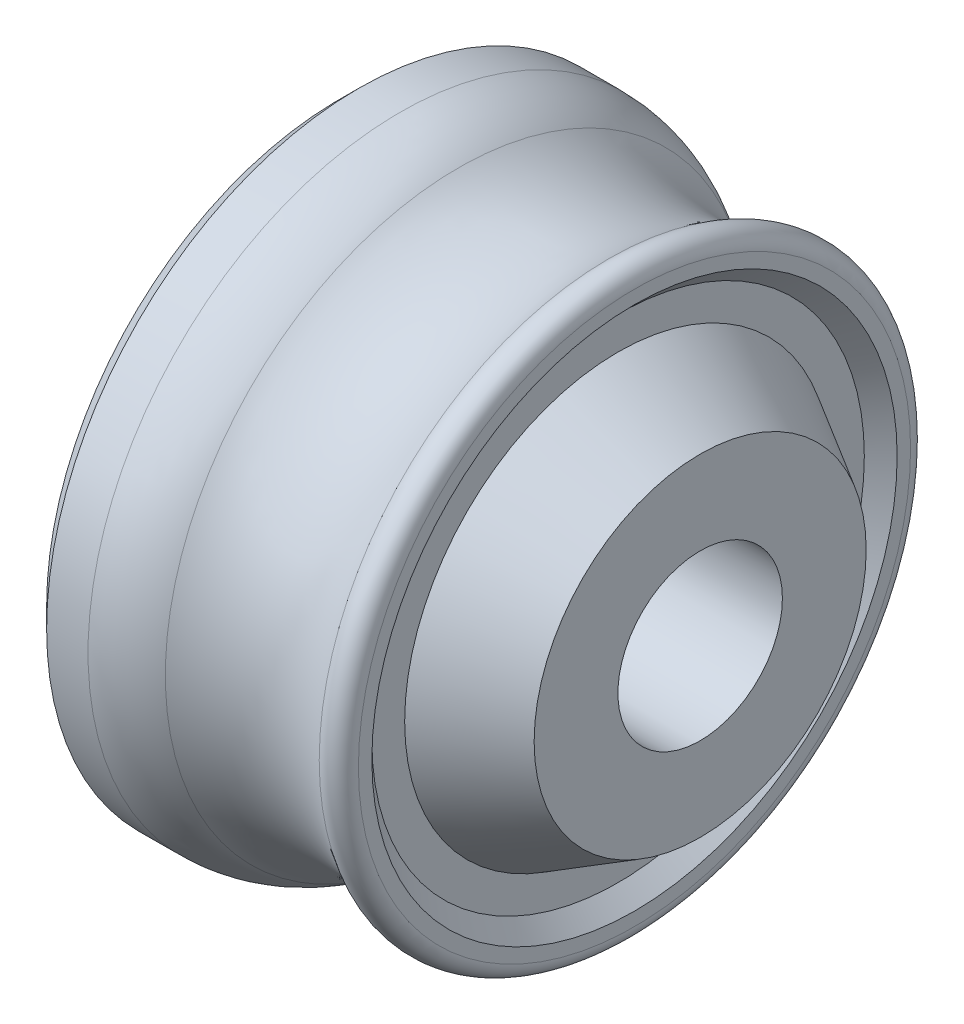
ISO-10303-21;
HEADER;
FILE_DESCRIPTION(('STEP AP214'),'2;1');
FILE_NAME('part.step','',(''),(''),'','','');
FILE_SCHEMA(('AUTOMOTIVE_DESIGN { 1 0 10303 214 1 1 1 1 }'));
ENDSEC;
DATA;
#1=APPLICATION_CONTEXT('core data for automotive mechanical design processes');
#2=APPLICATION_PROTOCOL_DEFINITION('international standard','automotive_design',2000,#1);
#3=PRODUCT_CONTEXT('',#1,'mechanical');
#4=PRODUCT('Part','Part','',(#3));
#5=PRODUCT_RELATED_PRODUCT_CATEGORY('part','',(#4));
#6=PRODUCT_DEFINITION_FORMATION('','',#4);
#7=PRODUCT_DEFINITION_CONTEXT('part definition',#1,'design');
#8=PRODUCT_DEFINITION('design','',#6,#7);
#9=PRODUCT_DEFINITION_SHAPE('','',#8);
#10=(LENGTH_UNIT() NAMED_UNIT(*) SI_UNIT(.MILLI.,.METRE.));
#11=(NAMED_UNIT(*) PLANE_ANGLE_UNIT() SI_UNIT($,.RADIAN.));
#12=(NAMED_UNIT(*) SI_UNIT($,.STERADIAN.) SOLID_ANGLE_UNIT());
#13=UNCERTAINTY_MEASURE_WITH_UNIT(LENGTH_MEASURE(1.E-05),#10,'distance_accuracy_value','');
#14=(GEOMETRIC_REPRESENTATION_CONTEXT(3) GLOBAL_UNCERTAINTY_ASSIGNED_CONTEXT((#13)) GLOBAL_UNIT_ASSIGNED_CONTEXT((#10,
#11,#12)) REPRESENTATION_CONTEXT('',''));
#15=CARTESIAN_POINT('',(0.,0.,0.));
#16=DIRECTION('',(0.,0.,1.));
#17=DIRECTION('',(1.,0.,0.));
#18=AXIS2_PLACEMENT_3D('',#15,#16,#17);
#19=CARTESIAN_POINT('',(0.,0.,0.));
#20=DIRECTION('',(1.,0.,0.));
#21=DIRECTION('',(0.,0.,-1.));
#22=AXIS2_PLACEMENT_3D('',#19,#20,#21);
#23=TOROIDAL_SURFACE('',#22,12.1507513110646,4.);
#24=CARTESIAN_POINT('',(-2.3647404575098,0.,0.));
#25=DIRECTION('',(1.,0.,0.));
#26=DIRECTION('',(0.,0.,-1.));
#27=AXIS2_PLACEMENT_3D('',#24,#25,#26);
#28=CIRCLE('',#27,8.92460770474197);
#29=CARTESIAN_POINT('',(-2.3647404575098,0.,-8.92460770474197));
#30=VERTEX_POINT('',#29);
#31=EDGE_CURVE('E64',#30,#30,#28,.T.);
#32=ORIENTED_EDGE('',*,*,#31,.T.);
#33=EDGE_LOOP('',(#32));
#34=FACE_BOUND('',#33,.T.);
#35=CARTESIAN_POINT('',(2.22222222222222,0.,0.));
#36=DIRECTION('',(-1.,0.,0.));
#37=DIRECTION('',(0.,0.,1.));
#38=AXIS2_PLACEMENT_3D('',#35,#36,#37);
#39=CIRCLE('',#38,8.8248336339322);
#40=CARTESIAN_POINT('',(2.22222222222222,0.,8.8248336339322));
#41=VERTEX_POINT('',#40);
#42=EDGE_CURVE('E72',#41,#41,#39,.T.);
#43=ORIENTED_EDGE('',*,*,#42,.T.);
#44=EDGE_LOOP('',(#43));
#45=FACE_BOUND('',#44,.T.);
#46=ADVANCED_FACE('F39',(#34,#45),#23,.F.);
#47=CARTESIAN_POINT('',(0.,0.,0.));
#48=DIRECTION('',(1.,0.,0.));
#49=DIRECTION('',(0.,0.,-1.));
#50=AXIS2_PLACEMENT_3D('',#47,#48,#49);
#51=CYLINDRICAL_SURFACE('',#50,2.505);
#52=CARTESIAN_POINT('',(-5.4,0.,0.));
#53=DIRECTION('',(-1.,0.,0.));
#54=DIRECTION('',(0.,0.,1.));
#55=AXIS2_PLACEMENT_3D('',#52,#53,#54);
#56=CIRCLE('',#55,2.505);
#57=CARTESIAN_POINT('',(-5.4,0.,2.505));
#58=VERTEX_POINT('',#57);
#59=EDGE_CURVE('E58',#58,#58,#56,.T.);
#60=ORIENTED_EDGE('',*,*,#59,.T.);
#61=EDGE_LOOP('',(#60));
#62=FACE_BOUND('',#61,.T.);
#63=CARTESIAN_POINT('',(5.,0.,0.));
#64=DIRECTION('',(1.,0.,0.));
#65=DIRECTION('',(0.,0.,-1.));
#66=AXIS2_PLACEMENT_3D('',#63,#64,#65);
#67=CIRCLE('',#66,2.505);
#68=CARTESIAN_POINT('',(5.,0.,-2.505));
#69=VERTEX_POINT('',#68);
#70=EDGE_CURVE('E96',#69,#69,#67,.T.);
#71=ORIENTED_EDGE('',*,*,#70,.T.);
#72=EDGE_LOOP('',(#71));
#73=FACE_BOUND('',#72,.T.);
#74=ADVANCED_FACE('F101',(#62,#73),#51,.F.);
#75=CARTESIAN_POINT('',(3.,-2.505,0.));
#76=DIRECTION('',(-1.,0.,0.));
#77=DIRECTION('',(0.,0.,1.));
#78=AXIS2_PLACEMENT_3D('',#75,#76,#77);
#79=PLANE('',#78);
#80=CARTESIAN_POINT('',(3.,0.,0.));
#81=DIRECTION('',(-1.,0.,0.));
#82=DIRECTION('',(0.,0.,1.));
#83=AXIS2_PLACEMENT_3D('',#80,#81,#82);
#84=CIRCLE('',#83,8.40909392429065);
#85=CARTESIAN_POINT('',(3.,0.,8.40909392429065));
#86=VERTEX_POINT('',#85);
#87=EDGE_CURVE('E76',#86,#86,#84,.F.);
#88=ORIENTED_EDGE('',*,*,#87,.T.);
#89=EDGE_LOOP('',(#88));
#90=FACE_BOUND('',#89,.T.);
#91=CARTESIAN_POINT('',(3.,0.,0.));
#92=DIRECTION('',(-1.,0.,0.));
#93=DIRECTION('',(0.,0.,1.));
#94=AXIS2_PLACEMENT_3D('',#91,#92,#93);
#95=CIRCLE('',#94,8.00000000000001);
#96=CARTESIAN_POINT('',(3.,0.,8.00000000000001));
#97=VERTEX_POINT('',#96);
#98=EDGE_CURVE('E92',#97,#97,#95,.T.);
#99=ORIENTED_EDGE('',*,*,#98,.T.);
#100=EDGE_LOOP('',(#99));
#101=FACE_BOUND('',#100,.T.);
#102=ADVANCED_FACE('F127',(#90,#101),#79,.F.);
#103=CARTESIAN_POINT('',(2.5,0.,0.));
#104=DIRECTION('',(1.,0.,0.));
#105=DIRECTION('',(0.,0.,-1.));
#106=AXIS2_PLACEMENT_3D('',#103,#104,#105);
#107=PLANE('',#106);
#108=CARTESIAN_POINT('',(2.5,0.,0.));
#109=DIRECTION('',(1.,0.,0.));
#110=DIRECTION('',(0.,0.,-1.));
#111=AXIS2_PLACEMENT_3D('',#108,#109,#110);
#112=CIRCLE('',#111,6.50000000000002);
#113=CARTESIAN_POINT('',(2.5,0.,-6.50000000000002));
#114=VERTEX_POINT('',#113);
#115=EDGE_CURVE('E84',#114,#114,#112,.F.);
#116=ORIENTED_EDGE('',*,*,#115,.T.);
#117=EDGE_LOOP('',(#116));
#118=FACE_BOUND('',#117,.T.);
#119=CARTESIAN_POINT('',(2.5,0.,0.));
#120=DIRECTION('',(1.,0.,0.));
#121=DIRECTION('',(0.,0.,-1.));
#122=AXIS2_PLACEMENT_3D('',#119,#120,#121);
#123=CIRCLE('',#122,7.50000000000001);
#124=CARTESIAN_POINT('',(2.5,0.,-7.50000000000001));
#125=VERTEX_POINT('',#124);
#126=EDGE_CURVE('E88',#125,#125,#123,.T.);
#127=ORIENTED_EDGE('',*,*,#126,.T.);
#128=EDGE_LOOP('',(#127));
#129=FACE_BOUND('',#128,.T.);
#130=ADVANCED_FACE('F116',(#118,#129),#107,.T.);
#131=CARTESIAN_POINT('',(1.99999999999998,0.,0.));
#132=DIRECTION('',(1.,0.,0.));
#133=DIRECTION('',(0.,0.,-1.));
#134=AXIS2_PLACEMENT_3D('',#131,#132,#133);
#135=CONICAL_SURFACE('',#134,7.,0.785398163397443);
#136=ORIENTED_EDGE('',*,*,#98,.F.);
#137=EDGE_LOOP('',(#136));
#138=FACE_BOUND('',#137,.T.);
#139=ORIENTED_EDGE('',*,*,#126,.F.);
#140=EDGE_LOOP('',(#139));
#141=FACE_BOUND('',#140,.T.);
#142=ADVANCED_FACE('F106',(#138,#141),#135,.F.);
#143=CARTESIAN_POINT('',(5.,0.,0.));
#144=DIRECTION('',(1.,0.,0.));
#145=DIRECTION('',(0.,0.,-1.));
#146=AXIS2_PLACEMENT_3D('',#143,#144,#145);
#147=PLANE('',#146);
#148=CARTESIAN_POINT('',(5.,0.,0.));
#149=DIRECTION('',(1.,0.,0.));
#150=DIRECTION('',(0.,0.,-1.));
#151=AXIS2_PLACEMENT_3D('',#148,#149,#150);
#152=CIRCLE('',#151,5.05662432702597);
#153=CARTESIAN_POINT('',(5.,0.,-5.05662432702597));
#154=VERTEX_POINT('',#153);
#155=EDGE_CURVE('E80',#154,#154,#152,.T.);
#156=ORIENTED_EDGE('',*,*,#155,.T.);
#157=EDGE_LOOP('',(#156));
#158=FACE_BOUND('',#157,.T.);
#159=ORIENTED_EDGE('',*,*,#70,.F.);
#160=EDGE_LOOP('',(#159));
#161=FACE_BOUND('',#160,.T.);
#162=ADVANCED_FACE('F103',(#158,#161),#147,.T.);
#163=CARTESIAN_POINT('',(5.96410161513783,0.,0.));
#164=DIRECTION('',(-1.,0.,0.));
#165=DIRECTION('',(0.,0.,1.));
#166=AXIS2_PLACEMENT_3D('',#163,#164,#165);
#167=CONICAL_SURFACE('',#166,4.5,0.523598775598295);
#168=ORIENTED_EDGE('',*,*,#115,.F.);
#169=EDGE_LOOP('',(#168));
#170=FACE_BOUND('',#169,.T.);
#171=ORIENTED_EDGE('',*,*,#155,.F.);
#172=EDGE_LOOP('',(#171));
#173=FACE_BOUND('',#172,.T.);
#174=ADVANCED_FACE('F105',(#170,#173),#167,.T.);
#175=CARTESIAN_POINT('',(-6.,0.,0.));
#176=DIRECTION('',(-1.,0.,0.));
#177=DIRECTION('',(0.,0.,1.));
#178=AXIS2_PLACEMENT_3D('',#175,#176,#177);
#179=PLANE('',#178);
#180=CARTESIAN_POINT('',(-6.,0.,0.));
#181=DIRECTION('',(-1.,0.,0.));
#182=DIRECTION('',(0.,0.,1.));
#183=AXIS2_PLACEMENT_3D('',#180,#181,#182);
#184=CIRCLE('',#183,3.105);
#185=CARTESIAN_POINT('',(-6.,0.,3.105));
#186=VERTEX_POINT('',#185);
#187=EDGE_CURVE('E48',#186,#186,#184,.F.);
#188=ORIENTED_EDGE('',*,*,#187,.T.);
#189=EDGE_LOOP('',(#188));
#190=FACE_BOUND('',#189,.T.);
#191=CARTESIAN_POINT('',(-6.,0.,0.));
#192=DIRECTION('',(-1.,0.,0.));
#193=DIRECTION('',(0.,0.,1.));
#194=AXIS2_PLACEMENT_3D('',#191,#192,#193);
#195=CIRCLE('',#194,8.905);
#196=CARTESIAN_POINT('',(-6.,0.,8.905));
#197=VERTEX_POINT('',#196);
#198=EDGE_CURVE('E53',#197,#197,#195,.T.);
#199=ORIENTED_EDGE('',*,*,#198,.T.);
#200=EDGE_LOOP('',(#199));
#201=FACE_BOUND('',#200,.T.);
#202=ADVANCED_FACE('F113',(#190,#201),#179,.T.);
#203=CARTESIAN_POINT('',(-6.,0.,0.));
#204=DIRECTION('',(1.,0.,0.));
#205=DIRECTION('',(0.,0.,-1.));
#206=AXIS2_PLACEMENT_3D('',#203,#204,#205);
#207=CYLINDRICAL_SURFACE('',#206,9.505);
#208=CARTESIAN_POINT('',(-5.4,0.,0.));
#209=DIRECTION('',(-1.,0.,0.));
#210=DIRECTION('',(0.,0.,1.));
#211=AXIS2_PLACEMENT_3D('',#208,#209,#210);
#212=CIRCLE('',#211,9.505);
#213=CARTESIAN_POINT('',(-5.4,0.,9.505));
#214=VERTEX_POINT('',#213);
#215=EDGE_CURVE('E10',#214,#214,#212,.F.);
#216=ORIENTED_EDGE('',*,*,#215,.T.);
#217=EDGE_LOOP('',(#216));
#218=FACE_BOUND('',#217,.T.);
#219=CARTESIAN_POINT('',(-4.13829580064215,0.,0.));
#220=DIRECTION('',(1.,0.,0.));
#221=DIRECTION('',(0.,0.,-1.));
#222=AXIS2_PLACEMENT_3D('',#219,#220,#221);
#223=CIRCLE('',#222,9.505);
#224=CARTESIAN_POINT('',(-4.13829580064215,0.,-9.505));
#225=VERTEX_POINT('',#224);
#226=EDGE_CURVE('E68',#225,#225,#223,.F.);
#227=ORIENTED_EDGE('',*,*,#226,.T.);
#228=EDGE_LOOP('',(#227));
#229=FACE_BOUND('',#228,.T.);
#230=ADVANCED_FACE('F144',(#218,#229),#207,.T.);
#231=CARTESIAN_POINT('',(2.5,0.,0.));
#232=DIRECTION('',(1.,0.,0.));
#233=DIRECTION('',(0.,0.,-1.));
#234=AXIS2_PLACEMENT_3D('',#231,#232,#233);
#235=TOROIDAL_SURFACE('',#234,8.40909392429065,0.5);
#236=ORIENTED_EDGE('',*,*,#42,.F.);
#237=EDGE_LOOP('',(#236));
#238=FACE_BOUND('',#237,.T.);
#239=ORIENTED_EDGE('',*,*,#87,.F.);
#240=EDGE_LOOP('',(#239));
#241=FACE_BOUND('',#240,.T.);
#242=ADVANCED_FACE('F140',(#238,#241),#235,.T.);
#243=CARTESIAN_POINT('',(-4.13829580064215,0.,0.));
#244=DIRECTION('',(1.,0.,0.));
#245=DIRECTION('',(0.,0.,-1.));
#246=AXIS2_PLACEMENT_3D('',#243,#244,#245);
#247=TOROIDAL_SURFACE('',#246,6.505,3.);
#248=ORIENTED_EDGE('',*,*,#31,.F.);
#249=EDGE_LOOP('',(#248));
#250=FACE_BOUND('',#249,.T.);
#251=ORIENTED_EDGE('',*,*,#226,.F.);
#252=EDGE_LOOP('',(#251));
#253=FACE_BOUND('',#252,.T.);
#254=ADVANCED_FACE('F143',(#250,#253),#247,.T.);
#255=CARTESIAN_POINT('',(-5.4,0.,0.));
#256=DIRECTION('',(-1.,0.,0.));
#257=DIRECTION('',(0.,0.,1.));
#258=AXIS2_PLACEMENT_3D('',#255,#256,#257);
#259=CONICAL_SURFACE('',#258,2.505,0.785398163397449);
#260=ORIENTED_EDGE('',*,*,#187,.F.);
#261=EDGE_LOOP('',(#260));
#262=FACE_BOUND('',#261,.T.);
#263=ORIENTED_EDGE('',*,*,#59,.F.);
#264=EDGE_LOOP('',(#263));
#265=FACE_BOUND('',#264,.T.);
#266=ADVANCED_FACE('F147',(#262,#265),#259,.F.);
#267=CARTESIAN_POINT('',(-6.,0.,0.));
#268=DIRECTION('',(1.,0.,0.));
#269=DIRECTION('',(0.,0.,-1.));
#270=AXIS2_PLACEMENT_3D('',#267,#268,#269);
#271=CONICAL_SURFACE('',#270,8.905,0.78539816339745);
#272=ORIENTED_EDGE('',*,*,#215,.F.);
#273=EDGE_LOOP('',(#272));
#274=FACE_BOUND('',#273,.T.);
#275=ORIENTED_EDGE('',*,*,#198,.F.);
#276=EDGE_LOOP('',(#275));
#277=FACE_BOUND('',#276,.T.);
#278=ADVANCED_FACE('F42',(#274,#277),#271,.T.);
#279=CLOSED_SHELL('',(#46,#74,#102,#130,#142,#162,#174,#202,#230,#242,#254,#266,#278));
#280=MANIFOLD_SOLID_BREP('B2',#279);
#281=ADVANCED_BREP_SHAPE_REPRESENTATION('',(#18,#280),#14);
#282=SHAPE_DEFINITION_REPRESENTATION(#9,#281);
ENDSEC;
END-ISO-10303-21;
